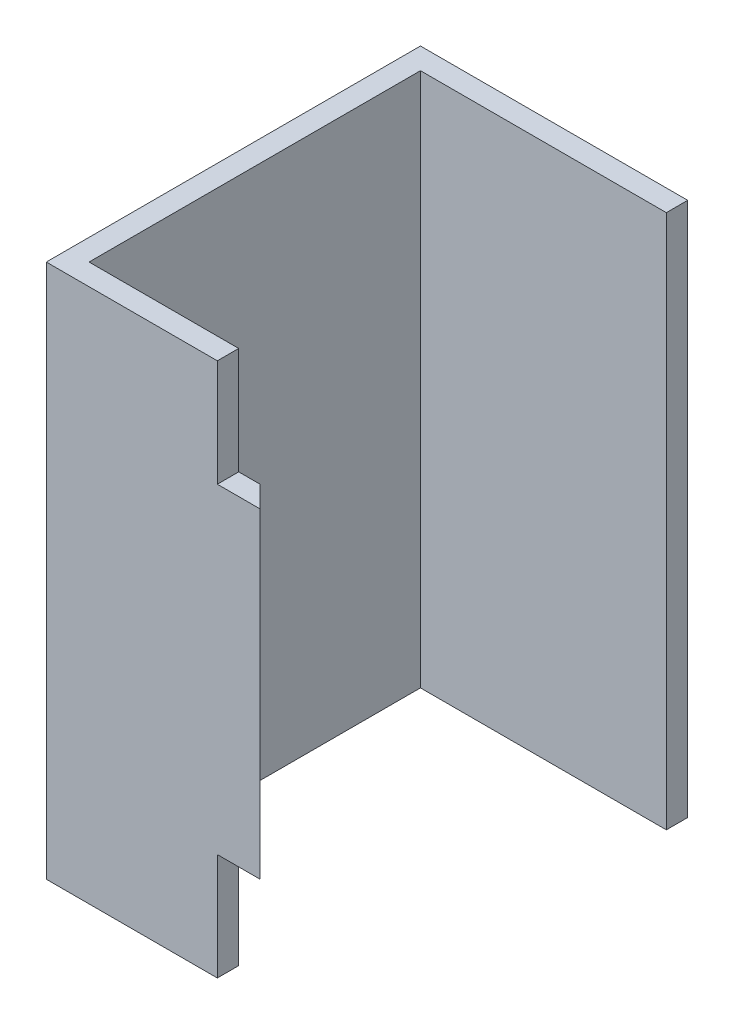
ISO-10303-21;
HEADER;
FILE_DESCRIPTION(('STEP AP214'),'2;1');
FILE_NAME('part.step','',(''),(''),'','','');
FILE_SCHEMA(('AUTOMOTIVE_DESIGN { 1 0 10303 214 1 1 1 1 }'));
ENDSEC;
DATA;
#1=APPLICATION_CONTEXT('core data for automotive mechanical design processes');
#2=APPLICATION_PROTOCOL_DEFINITION('international standard','automotive_design',2000,#1);
#3=PRODUCT_CONTEXT('',#1,'mechanical');
#4=PRODUCT('Part','Part','',(#3));
#5=PRODUCT_RELATED_PRODUCT_CATEGORY('part','',(#4));
#6=PRODUCT_DEFINITION_FORMATION('','',#4);
#7=PRODUCT_DEFINITION_CONTEXT('part definition',#1,'design');
#8=PRODUCT_DEFINITION('design','',#6,#7);
#9=PRODUCT_DEFINITION_SHAPE('','',#8);
#10=(LENGTH_UNIT() NAMED_UNIT(*) SI_UNIT(.MILLI.,.METRE.));
#11=(NAMED_UNIT(*) PLANE_ANGLE_UNIT() SI_UNIT($,.RADIAN.));
#12=(NAMED_UNIT(*) SI_UNIT($,.STERADIAN.) SOLID_ANGLE_UNIT());
#13=UNCERTAINTY_MEASURE_WITH_UNIT(LENGTH_MEASURE(1.E-05),#10,'distance_accuracy_value','');
#14=(GEOMETRIC_REPRESENTATION_CONTEXT(3) GLOBAL_UNCERTAINTY_ASSIGNED_CONTEXT((#13)) GLOBAL_UNIT_ASSIGNED_CONTEXT((#10,
#11,#12)) REPRESENTATION_CONTEXT('',''));
#15=CARTESIAN_POINT('',(0.,0.,0.));
#16=DIRECTION('',(0.,0.,1.));
#17=DIRECTION('',(1.,0.,0.));
#18=AXIS2_PLACEMENT_3D('',#15,#16,#17);
#19=CARTESIAN_POINT('',(-0.48,-0.25,0.02));
#20=DIRECTION('',(0.,0.,1.));
#21=DIRECTION('',(1.,0.,0.));
#22=AXIS2_PLACEMENT_3D('',#19,#20,#21);
#23=PLANE('',#22);
#24=DIRECTION('',(0.,1.,0.));
#25=VECTOR('',#24,1.);
#26=CARTESIAN_POINT('',(-0.25,-0.25,0.02));
#27=LINE('',#26,#25);
#28=CARTESIAN_POINT('',(-0.25,-0.25,0.02));
#29=VERTEX_POINT('',#28);
#30=CARTESIAN_POINT('',(-0.25,0.25,0.02));
#31=VERTEX_POINT('',#30);
#32=EDGE_CURVE('E11',#29,#31,#27,.T.);
#33=ORIENTED_EDGE('',*,*,#32,.T.);
#34=DIRECTION('',(1.,0.,0.));
#35=VECTOR('',#34,1.);
#36=CARTESIAN_POINT('',(-0.48,0.25,0.02));
#37=LINE('',#36,#35);
#38=CARTESIAN_POINT('',(-0.48,0.25,0.02));
#39=VERTEX_POINT('',#38);
#40=EDGE_CURVE('E24',#39,#31,#37,.T.);
#41=ORIENTED_EDGE('',*,*,#40,.F.);
#42=DIRECTION('',(0.,1.,0.));
#43=VECTOR('',#42,1.);
#44=CARTESIAN_POINT('',(-0.48,-0.25,0.02));
#45=LINE('',#44,#43);
#46=CARTESIAN_POINT('',(-0.48,-0.25,0.02));
#47=VERTEX_POINT('',#46);
#48=EDGE_CURVE('E194',#47,#39,#45,.T.);
#49=ORIENTED_EDGE('',*,*,#48,.F.);
#50=DIRECTION('',(1.,0.,0.));
#51=VECTOR('',#50,1.);
#52=CARTESIAN_POINT('',(-0.48,-0.25,0.02));
#53=LINE('',#52,#51);
#54=EDGE_CURVE('E192',#47,#29,#53,.T.);
#55=ORIENTED_EDGE('',*,*,#54,.T.);
#56=EDGE_LOOP('',(#33,#41,#49,#55));
#57=FACE_BOUND('',#56,.T.);
#58=ADVANCED_FACE('F17',(#57),#23,.T.);
#59=CARTESIAN_POINT('',(-0.48,-0.25,0.33));
#60=DIRECTION('',(1.,0.,0.));
#61=DIRECTION('',(0.,0.,-1.));
#62=AXIS2_PLACEMENT_3D('',#59,#60,#61);
#63=PLANE('',#62);
#64=ORIENTED_EDGE('',*,*,#48,.T.);
#65=DIRECTION('',(0.,0.,-1.));
#66=VECTOR('',#65,1.);
#67=CARTESIAN_POINT('',(-0.48,0.25,0.33));
#68=LINE('',#67,#66);
#69=CARTESIAN_POINT('',(-0.48,0.25,0.33));
#70=VERTEX_POINT('',#69);
#71=EDGE_CURVE('E189',#70,#39,#68,.T.);
#72=ORIENTED_EDGE('',*,*,#71,.F.);
#73=DIRECTION('',(0.,1.,0.));
#74=VECTOR('',#73,1.);
#75=CARTESIAN_POINT('',(-0.48,-0.25,0.33));
#76=LINE('',#75,#74);
#77=CARTESIAN_POINT('',(-0.48,-0.25,0.33));
#78=VERTEX_POINT('',#77);
#79=EDGE_CURVE('E186',#78,#70,#76,.T.);
#80=ORIENTED_EDGE('',*,*,#79,.F.);
#81=DIRECTION('',(0.,0.,-1.));
#82=VECTOR('',#81,1.);
#83=CARTESIAN_POINT('',(-0.48,-0.25,0.33));
#84=LINE('',#83,#82);
#85=EDGE_CURVE('E183',#78,#47,#84,.T.);
#86=ORIENTED_EDGE('',*,*,#85,.T.);
#87=EDGE_LOOP('',(#64,#72,#80,#86));
#88=FACE_BOUND('',#87,.T.);
#89=ADVANCED_FACE('F200',(#88),#63,.T.);
#90=CARTESIAN_POINT('',(-0.32,-0.25,0.33));
#91=DIRECTION('',(0.,0.,-1.));
#92=DIRECTION('',(-1.,0.,0.));
#93=AXIS2_PLACEMENT_3D('',#90,#91,#92);
#94=PLANE('',#93);
#95=DIRECTION('',(0.,-1.,0.));
#96=VECTOR('',#95,1.);
#97=CARTESIAN_POINT('',(-0.34,0.25,0.33));
#98=LINE('',#97,#96);
#99=CARTESIAN_POINT('',(-0.34,0.25,0.33));
#100=VERTEX_POINT('',#99);
#101=CARTESIAN_POINT('',(-0.34,0.15,0.33));
#102=VERTEX_POINT('',#101);
#103=EDGE_CURVE('E181',#100,#102,#98,.T.);
#104=ORIENTED_EDGE('',*,*,#103,.T.);
#105=DIRECTION('',(1.,0.,0.));
#106=VECTOR('',#105,1.);
#107=CARTESIAN_POINT('',(-0.34,0.15,0.33));
#108=LINE('',#107,#106);
#109=CARTESIAN_POINT('',(-0.32,0.15,0.33));
#110=VERTEX_POINT('',#109);
#111=EDGE_CURVE('E179',#102,#110,#108,.T.);
#112=ORIENTED_EDGE('',*,*,#111,.T.);
#113=DIRECTION('',(0.,1.,0.));
#114=VECTOR('',#113,1.);
#115=CARTESIAN_POINT('',(-0.32,-0.25,0.33));
#116=LINE('',#115,#114);
#117=CARTESIAN_POINT('',(-0.32,-0.15,0.33));
#118=VERTEX_POINT('',#117);
#119=EDGE_CURVE('E176',#118,#110,#116,.T.);
#120=ORIENTED_EDGE('',*,*,#119,.F.);
#121=DIRECTION('',(-1.,0.,0.));
#122=VECTOR('',#121,1.);
#123=CARTESIAN_POINT('',(-0.34,-0.15,0.33));
#124=LINE('',#123,#122);
#125=CARTESIAN_POINT('',(-0.34,-0.15,0.33));
#126=VERTEX_POINT('',#125);
#127=EDGE_CURVE('E174',#118,#126,#124,.T.);
#128=ORIENTED_EDGE('',*,*,#127,.T.);
#129=DIRECTION('',(0.,-1.,0.));
#130=VECTOR('',#129,1.);
#131=CARTESIAN_POINT('',(-0.34,-0.25,0.33));
#132=LINE('',#131,#130);
#133=CARTESIAN_POINT('',(-0.34,-0.25,0.33));
#134=VERTEX_POINT('',#133);
#135=EDGE_CURVE('E172',#126,#134,#132,.T.);
#136=ORIENTED_EDGE('',*,*,#135,.T.);
#137=DIRECTION('',(-1.,0.,0.));
#138=VECTOR('',#137,1.);
#139=CARTESIAN_POINT('',(-0.32,-0.25,0.33));
#140=LINE('',#139,#138);
#141=EDGE_CURVE('E169',#134,#78,#140,.T.);
#142=ORIENTED_EDGE('',*,*,#141,.T.);
#143=ORIENTED_EDGE('',*,*,#79,.T.);
#144=DIRECTION('',(-1.,0.,0.));
#145=VECTOR('',#144,1.);
#146=CARTESIAN_POINT('',(-0.32,0.25,0.33));
#147=LINE('',#146,#145);
#148=EDGE_CURVE('E166',#100,#70,#147,.T.);
#149=ORIENTED_EDGE('',*,*,#148,.F.);
#150=EDGE_LOOP('',(#104,#112,#120,#128,#136,#142,#143,#149));
#151=FACE_BOUND('',#150,.T.);
#152=ADVANCED_FACE('F204',(#151),#94,.T.);
#153=CARTESIAN_POINT('',(-0.3,-0.25,0.35));
#154=DIRECTION('',(0.707106781186542,0.,-0.707106781186553));
#155=DIRECTION('',(-0.707106781186553,0.,-0.707106781186542));
#156=AXIS2_PLACEMENT_3D('',#153,#154,#155);
#157=PLANE('',#156);
#158=DIRECTION('',(0.707106781186553,0.,0.707106781186542));
#159=VECTOR('',#158,1.);
#160=CARTESIAN_POINT('',(-0.4955,0.15,0.154500000000003));
#161=LINE('',#160,#159);
#162=CARTESIAN_POINT('',(-0.3,0.15,0.35));
#163=VERTEX_POINT('',#162);
#164=EDGE_CURVE('E164',#110,#163,#161,.T.);
#165=ORIENTED_EDGE('',*,*,#164,.T.);
#166=DIRECTION('',(0.,1.,0.));
#167=VECTOR('',#166,1.);
#168=CARTESIAN_POINT('',(-0.3,-0.25,0.35));
#169=LINE('',#168,#167);
#170=CARTESIAN_POINT('',(-0.3,-0.15,0.35));
#171=VERTEX_POINT('',#170);
#172=EDGE_CURVE('E161',#171,#163,#169,.T.);
#173=ORIENTED_EDGE('',*,*,#172,.F.);
#174=DIRECTION('',(-0.707106781186553,0.,-0.707106781186542));
#175=VECTOR('',#174,1.);
#176=CARTESIAN_POINT('',(-0.4955,-0.15,0.154500000000003));
#177=LINE('',#176,#175);
#178=EDGE_CURVE('E158',#171,#118,#177,.T.);
#179=ORIENTED_EDGE('',*,*,#178,.T.);
#180=ORIENTED_EDGE('',*,*,#119,.T.);
#181=EDGE_LOOP('',(#165,#173,#179,#180));
#182=FACE_BOUND('',#181,.T.);
#183=ADVANCED_FACE('F238',(#182),#157,.T.);
#184=CARTESIAN_POINT('',(-0.5,-0.25,0.35));
#185=DIRECTION('',(0.,0.,1.));
#186=DIRECTION('',(1.,0.,0.));
#187=AXIS2_PLACEMENT_3D('',#184,#185,#186);
#188=PLANE('',#187);
#189=DIRECTION('',(0.,-1.,0.));
#190=VECTOR('',#189,1.);
#191=CARTESIAN_POINT('',(-0.34,0.25,0.35));
#192=LINE('',#191,#190);
#193=CARTESIAN_POINT('',(-0.34,0.25,0.35));
#194=VERTEX_POINT('',#193);
#195=CARTESIAN_POINT('',(-0.34,0.15,0.35));
#196=VERTEX_POINT('',#195);
#197=EDGE_CURVE('E156',#194,#196,#192,.T.);
#198=ORIENTED_EDGE('',*,*,#197,.F.);
#199=DIRECTION('',(1.,0.,0.));
#200=VECTOR('',#199,1.);
#201=CARTESIAN_POINT('',(-0.5,0.25,0.35));
#202=LINE('',#201,#200);
#203=CARTESIAN_POINT('',(-0.5,0.25,0.35));
#204=VERTEX_POINT('',#203);
#205=EDGE_CURVE('E153',#204,#194,#202,.T.);
#206=ORIENTED_EDGE('',*,*,#205,.F.);
#207=DIRECTION('',(0.,1.,0.));
#208=VECTOR('',#207,1.);
#209=CARTESIAN_POINT('',(-0.5,-0.25,0.35));
#210=LINE('',#209,#208);
#211=CARTESIAN_POINT('',(-0.5,-0.25,0.35));
#212=VERTEX_POINT('',#211);
#213=EDGE_CURVE('E150',#212,#204,#210,.T.);
#214=ORIENTED_EDGE('',*,*,#213,.F.);
#215=DIRECTION('',(1.,0.,0.));
#216=VECTOR('',#215,1.);
#217=CARTESIAN_POINT('',(-0.5,-0.25,0.35));
#218=LINE('',#217,#216);
#219=CARTESIAN_POINT('',(-0.34,-0.25,0.35));
#220=VERTEX_POINT('',#219);
#221=EDGE_CURVE('E148',#212,#220,#218,.T.);
#222=ORIENTED_EDGE('',*,*,#221,.T.);
#223=DIRECTION('',(0.,-1.,0.));
#224=VECTOR('',#223,1.);
#225=CARTESIAN_POINT('',(-0.34,-0.25,0.35));
#226=LINE('',#225,#224);
#227=CARTESIAN_POINT('',(-0.34,-0.15,0.35));
#228=VERTEX_POINT('',#227);
#229=EDGE_CURVE('E145',#228,#220,#226,.T.);
#230=ORIENTED_EDGE('',*,*,#229,.F.);
#231=DIRECTION('',(-1.,0.,0.));
#232=VECTOR('',#231,1.);
#233=CARTESIAN_POINT('',(-0.34,-0.15,0.35));
#234=LINE('',#233,#232);
#235=EDGE_CURVE('E142',#171,#228,#234,.T.);
#236=ORIENTED_EDGE('',*,*,#235,.F.);
#237=ORIENTED_EDGE('',*,*,#172,.T.);
#238=DIRECTION('',(1.,0.,0.));
#239=VECTOR('',#238,1.);
#240=CARTESIAN_POINT('',(-0.34,0.15,0.35));
#241=LINE('',#240,#239);
#242=EDGE_CURVE('E139',#196,#163,#241,.T.);
#243=ORIENTED_EDGE('',*,*,#242,.F.);
#244=EDGE_LOOP('',(#198,#206,#214,#222,#230,#236,#237,#243));
#245=FACE_BOUND('',#244,.T.);
#246=ADVANCED_FACE('F227',(#245),#188,.T.);
#247=CARTESIAN_POINT('',(-0.5,-0.25,0.));
#248=DIRECTION('',(-1.,0.,0.));
#249=DIRECTION('',(0.,0.,1.));
#250=AXIS2_PLACEMENT_3D('',#247,#248,#249);
#251=PLANE('',#250);
#252=ORIENTED_EDGE('',*,*,#213,.T.);
#253=DIRECTION('',(0.,0.,1.));
#254=VECTOR('',#253,1.);
#255=CARTESIAN_POINT('',(-0.5,0.25,0.));
#256=LINE('',#255,#254);
#257=CARTESIAN_POINT('',(-0.5,0.25,0.));
#258=VERTEX_POINT('',#257);
#259=EDGE_CURVE('E136',#258,#204,#256,.T.);
#260=ORIENTED_EDGE('',*,*,#259,.F.);
#261=DIRECTION('',(0.,1.,0.));
#262=VECTOR('',#261,1.);
#263=CARTESIAN_POINT('',(-0.5,-0.25,0.));
#264=LINE('',#263,#262);
#265=CARTESIAN_POINT('',(-0.5,-0.25,0.));
#266=VERTEX_POINT('',#265);
#267=EDGE_CURVE('E134',#266,#258,#264,.T.);
#268=ORIENTED_EDGE('',*,*,#267,.F.);
#269=DIRECTION('',(0.,0.,1.));
#270=VECTOR('',#269,1.);
#271=CARTESIAN_POINT('',(-0.5,-0.25,0.));
#272=LINE('',#271,#270);
#273=EDGE_CURVE('E120',#266,#212,#272,.T.);
#274=ORIENTED_EDGE('',*,*,#273,.T.);
#275=EDGE_LOOP('',(#252,#260,#268,#274));
#276=FACE_BOUND('',#275,.T.);
#277=ADVANCED_FACE('F229',(#276),#251,.T.);
#278=CARTESIAN_POINT('',(-0.25,-0.25,0.));
#279=DIRECTION('',(0.,0.,-1.));
#280=DIRECTION('',(-1.,0.,0.));
#281=AXIS2_PLACEMENT_3D('',#278,#279,#280);
#282=PLANE('',#281);
#283=ORIENTED_EDGE('',*,*,#267,.T.);
#284=DIRECTION('',(-1.,0.,0.));
#285=VECTOR('',#284,1.);
#286=CARTESIAN_POINT('',(-0.25,0.25,0.));
#287=LINE('',#286,#285);
#288=CARTESIAN_POINT('',(-0.25,0.25,0.));
#289=VERTEX_POINT('',#288);
#290=EDGE_CURVE('E108',#289,#258,#287,.T.);
#291=ORIENTED_EDGE('',*,*,#290,.F.);
#292=DIRECTION('',(0.,1.,0.));
#293=VECTOR('',#292,1.);
#294=CARTESIAN_POINT('',(-0.25,-0.25,0.));
#295=LINE('',#294,#293);
#296=CARTESIAN_POINT('',(-0.25,-0.25,0.));
#297=VERTEX_POINT('',#296);
#298=EDGE_CURVE('E102',#297,#289,#295,.T.);
#299=ORIENTED_EDGE('',*,*,#298,.F.);
#300=DIRECTION('',(-1.,0.,0.));
#301=VECTOR('',#300,1.);
#302=CARTESIAN_POINT('',(-0.25,-0.25,0.));
#303=LINE('',#302,#301);
#304=EDGE_CURVE('E106',#297,#266,#303,.T.);
#305=ORIENTED_EDGE('',*,*,#304,.T.);
#306=EDGE_LOOP('',(#283,#291,#299,#305));
#307=FACE_BOUND('',#306,.T.);
#308=ADVANCED_FACE('F105',(#307),#282,.T.);
#309=CARTESIAN_POINT('',(-0.25,-0.25,0.02));
#310=DIRECTION('',(1.,0.,0.));
#311=DIRECTION('',(0.,0.,-1.));
#312=AXIS2_PLACEMENT_3D('',#309,#310,#311);
#313=PLANE('',#312);
#314=ORIENTED_EDGE('',*,*,#298,.T.);
#315=DIRECTION('',(0.,0.,-1.));
#316=VECTOR('',#315,1.);
#317=CARTESIAN_POINT('',(-0.25,0.25,0.02));
#318=LINE('',#317,#316);
#319=EDGE_CURVE('E121',#31,#289,#318,.T.);
#320=ORIENTED_EDGE('',*,*,#319,.F.);
#321=ORIENTED_EDGE('',*,*,#32,.F.);
#322=DIRECTION('',(0.,0.,-1.));
#323=VECTOR('',#322,1.);
#324=CARTESIAN_POINT('',(-0.25,-0.25,0.02));
#325=LINE('',#324,#323);
#326=EDGE_CURVE('E117',#29,#297,#325,.T.);
#327=ORIENTED_EDGE('',*,*,#326,.T.);
#328=EDGE_LOOP('',(#314,#320,#321,#327));
#329=FACE_BOUND('',#328,.T.);
#330=ADVANCED_FACE('F123',(#329),#313,.T.);
#331=CARTESIAN_POINT('',(0.,-0.25,0.));
#332=DIRECTION('',(0.,1.,0.));
#333=DIRECTION('',(0.,0.,1.));
#334=AXIS2_PLACEMENT_3D('',#331,#332,#333);
#335=PLANE('',#334);
#336=ORIENTED_EDGE('',*,*,#141,.F.);
#337=DIRECTION('',(0.,0.,1.));
#338=VECTOR('',#337,1.);
#339=CARTESIAN_POINT('',(-0.34,-0.25,-0.00100000000000013));
#340=LINE('',#339,#338);
#341=EDGE_CURVE('E124',#134,#220,#340,.T.);
#342=ORIENTED_EDGE('',*,*,#341,.T.);
#343=ORIENTED_EDGE('',*,*,#221,.F.);
#344=ORIENTED_EDGE('',*,*,#273,.F.);
#345=ORIENTED_EDGE('',*,*,#304,.F.);
#346=ORIENTED_EDGE('',*,*,#326,.F.);
#347=ORIENTED_EDGE('',*,*,#54,.F.);
#348=ORIENTED_EDGE('',*,*,#85,.F.);
#349=EDGE_LOOP('',(#336,#342,#343,#344,#345,#346,#347,#348));
#350=FACE_BOUND('',#349,.T.);
#351=ADVANCED_FACE('F115',(#350),#335,.F.);
#352=CARTESIAN_POINT('',(0.,0.25,0.));
#353=DIRECTION('',(0.,1.,0.));
#354=DIRECTION('',(0.,0.,1.));
#355=AXIS2_PLACEMENT_3D('',#352,#353,#354);
#356=PLANE('',#355);
#357=DIRECTION('',(0.,0.,1.));
#358=VECTOR('',#357,1.);
#359=CARTESIAN_POINT('',(-0.34,0.25,-0.00100000000000013));
#360=LINE('',#359,#358);
#361=EDGE_CURVE('E128',#100,#194,#360,.T.);
#362=ORIENTED_EDGE('',*,*,#361,.F.);
#363=ORIENTED_EDGE('',*,*,#148,.T.);
#364=ORIENTED_EDGE('',*,*,#71,.T.);
#365=ORIENTED_EDGE('',*,*,#40,.T.);
#366=ORIENTED_EDGE('',*,*,#319,.T.);
#367=ORIENTED_EDGE('',*,*,#290,.T.);
#368=ORIENTED_EDGE('',*,*,#259,.T.);
#369=ORIENTED_EDGE('',*,*,#205,.T.);
#370=EDGE_LOOP('',(#362,#363,#364,#365,#366,#367,#368,#369));
#371=FACE_BOUND('',#370,.T.);
#372=ADVANCED_FACE('F198',(#371),#356,.T.);
#373=CARTESIAN_POINT('',(-0.34,0.25,-0.00100000000000013));
#374=DIRECTION('',(-1.,0.,0.));
#375=DIRECTION('',(0.,0.,1.));
#376=AXIS2_PLACEMENT_3D('',#373,#374,#375);
#377=PLANE('',#376);
#378=ORIENTED_EDGE('',*,*,#361,.T.);
#379=ORIENTED_EDGE('',*,*,#197,.T.);
#380=DIRECTION('',(0.,0.,1.));
#381=VECTOR('',#380,1.);
#382=CARTESIAN_POINT('',(-0.34,0.15,-0.00100000000000013));
#383=LINE('',#382,#381);
#384=EDGE_CURVE('E217',#102,#196,#383,.T.);
#385=ORIENTED_EDGE('',*,*,#384,.F.);
#386=ORIENTED_EDGE('',*,*,#103,.F.);
#387=EDGE_LOOP('',(#378,#379,#385,#386));
#388=FACE_BOUND('',#387,.T.);
#389=ADVANCED_FACE('F223',(#388),#377,.F.);
#390=CARTESIAN_POINT('',(-0.34,0.15,-0.00100000000000013));
#391=DIRECTION('',(0.,-1.,0.));
#392=DIRECTION('',(0.,0.,-1.));
#393=AXIS2_PLACEMENT_3D('',#390,#391,#392);
#394=PLANE('',#393);
#395=ORIENTED_EDGE('',*,*,#384,.T.);
#396=ORIENTED_EDGE('',*,*,#242,.T.);
#397=ORIENTED_EDGE('',*,*,#164,.F.);
#398=ORIENTED_EDGE('',*,*,#111,.F.);
#399=EDGE_LOOP('',(#395,#396,#397,#398));
#400=FACE_BOUND('',#399,.T.);
#401=ADVANCED_FACE('F256',(#400),#394,.F.);
#402=CARTESIAN_POINT('',(-0.34,-0.15,-0.00100000000000013));
#403=DIRECTION('',(0.,1.,0.));
#404=DIRECTION('',(0.,0.,1.));
#405=AXIS2_PLACEMENT_3D('',#402,#403,#404);
#406=PLANE('',#405);
#407=ORIENTED_EDGE('',*,*,#178,.F.);
#408=ORIENTED_EDGE('',*,*,#235,.T.);
#409=DIRECTION('',(0.,0.,1.));
#410=VECTOR('',#409,1.);
#411=CARTESIAN_POINT('',(-0.34,-0.15,-0.00100000000000013));
#412=LINE('',#411,#410);
#413=EDGE_CURVE('E212',#126,#228,#412,.T.);
#414=ORIENTED_EDGE('',*,*,#413,.F.);
#415=ORIENTED_EDGE('',*,*,#127,.F.);
#416=EDGE_LOOP('',(#407,#408,#414,#415));
#417=FACE_BOUND('',#416,.T.);
#418=ADVANCED_FACE('F215',(#417),#406,.F.);
#419=CARTESIAN_POINT('',(-0.34,-0.25,-0.00100000000000013));
#420=DIRECTION('',(-1.,0.,0.));
#421=DIRECTION('',(0.,0.,1.));
#422=AXIS2_PLACEMENT_3D('',#419,#420,#421);
#423=PLANE('',#422);
#424=ORIENTED_EDGE('',*,*,#413,.T.);
#425=ORIENTED_EDGE('',*,*,#229,.T.);
#426=ORIENTED_EDGE('',*,*,#341,.F.);
#427=ORIENTED_EDGE('',*,*,#135,.F.);
#428=EDGE_LOOP('',(#424,#425,#426,#427));
#429=FACE_BOUND('',#428,.T.);
#430=ADVANCED_FACE('F211',(#429),#423,.F.);
#431=CLOSED_SHELL('',(#58,#89,#152,#183,#246,#277,#308,#330,#351,#372,#389,#401,#418,#430));
#432=MANIFOLD_SOLID_BREP('B1',#431);
#433=ADVANCED_BREP_SHAPE_REPRESENTATION('',(#18,#432),#14);
#434=SHAPE_DEFINITION_REPRESENTATION(#9,#433);
ENDSEC;
END-ISO-10303-21;
